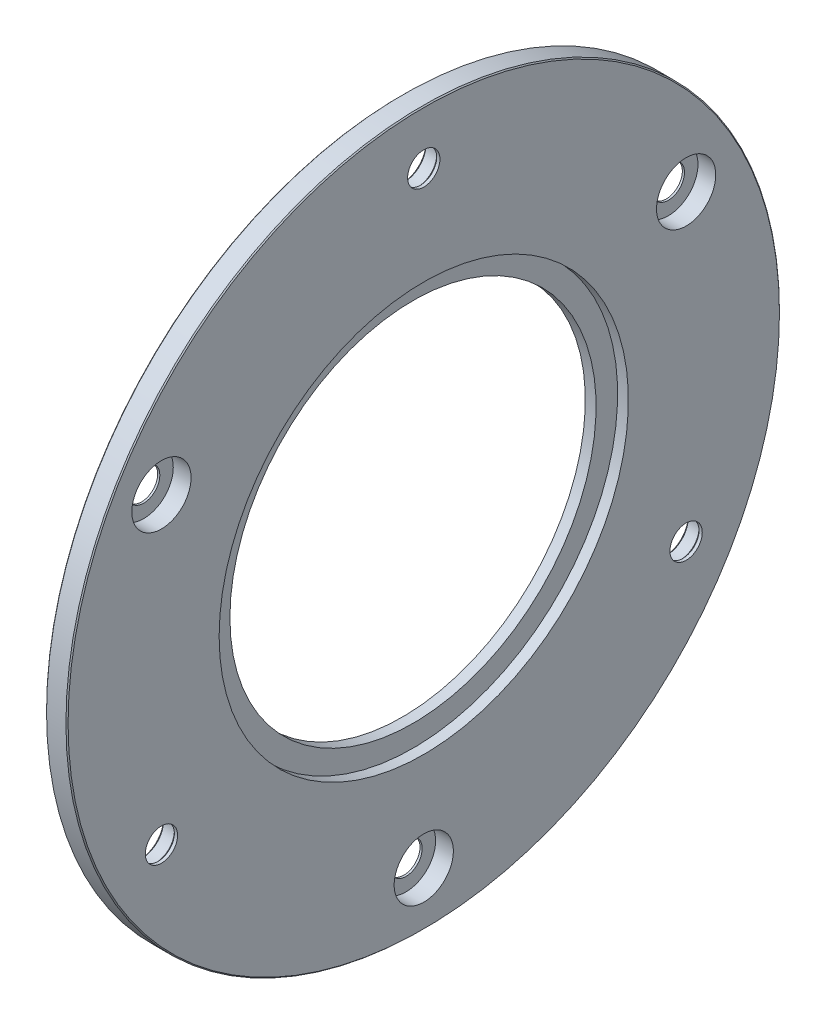
ISO-10303-21;
HEADER;
FILE_DESCRIPTION(('STEP AP214'),'2;1');
FILE_NAME('part.step','',(''),(''),'','','');
FILE_SCHEMA(('AUTOMOTIVE_DESIGN { 1 0 10303 214 1 1 1 1 }'));
ENDSEC;
DATA;
#1=APPLICATION_CONTEXT('core data for automotive mechanical design processes');
#2=APPLICATION_PROTOCOL_DEFINITION('international standard','automotive_design',2000,#1);
#3=PRODUCT_CONTEXT('',#1,'mechanical');
#4=PRODUCT('Part','Part','',(#3));
#5=PRODUCT_RELATED_PRODUCT_CATEGORY('part','',(#4));
#6=PRODUCT_DEFINITION_FORMATION('','',#4);
#7=PRODUCT_DEFINITION_CONTEXT('part definition',#1,'design');
#8=PRODUCT_DEFINITION('design','',#6,#7);
#9=PRODUCT_DEFINITION_SHAPE('','',#8);
#10=(LENGTH_UNIT() NAMED_UNIT(*) SI_UNIT(.MILLI.,.METRE.));
#11=(NAMED_UNIT(*) PLANE_ANGLE_UNIT() SI_UNIT($,.RADIAN.));
#12=(NAMED_UNIT(*) SI_UNIT($,.STERADIAN.) SOLID_ANGLE_UNIT());
#13=UNCERTAINTY_MEASURE_WITH_UNIT(LENGTH_MEASURE(1.E-05),#10,'distance_accuracy_value','');
#14=(GEOMETRIC_REPRESENTATION_CONTEXT(3) GLOBAL_UNCERTAINTY_ASSIGNED_CONTEXT((#13)) GLOBAL_UNIT_ASSIGNED_CONTEXT((#10,
#11,#12)) REPRESENTATION_CONTEXT('',''));
#15=CARTESIAN_POINT('',(0.,0.,0.));
#16=DIRECTION('',(0.,0.,1.));
#17=DIRECTION('',(1.,0.,0.));
#18=AXIS2_PLACEMENT_3D('',#15,#16,#17);
#19=CARTESIAN_POINT('',(34.,0.,0.));
#20=DIRECTION('',(1.,0.,0.));
#21=DIRECTION('',(0.,0.,-1.));
#22=AXIS2_PLACEMENT_3D('',#19,#20,#21);
#23=PLANE('',#22);
#24=CARTESIAN_POINT('',(34.,-28.1250000000002,48.7139289628746));
#25=DIRECTION('',(1.,0.,0.));
#26=DIRECTION('',(0.,0.,-1.));
#27=AXIS2_PLACEMENT_3D('',#24,#25,#26);
#28=CIRCLE('',#27,3.8);
#29=CARTESIAN_POINT('',(34.,-28.1250000000002,44.9139289628746));
#30=VERTEX_POINT('',#29);
#31=EDGE_CURVE('E72',#30,#30,#28,.F.);
#32=ORIENTED_EDGE('',*,*,#31,.T.);
#33=EDGE_LOOP('',(#32));
#34=FACE_BOUND('',#33,.T.);
#35=CARTESIAN_POINT('',(34.,-28.1250000000002,48.7139289628746));
#36=DIRECTION('',(1.,0.,0.));
#37=DIRECTION('',(0.,0.,-1.));
#38=AXIS2_PLACEMENT_3D('',#35,#36,#37);
#39=CIRCLE('',#38,3.39999999999993);
#40=CARTESIAN_POINT('',(34.,-28.1250000000002,45.3139289628746));
#41=VERTEX_POINT('',#40);
#42=EDGE_CURVE('E99',#41,#41,#39,.T.);
#43=ORIENTED_EDGE('',*,*,#42,.T.);
#44=EDGE_LOOP('',(#43));
#45=FACE_BOUND('',#44,.T.);
#46=ADVANCED_FACE('F35',(#34,#45),#23,.F.);
#47=CARTESIAN_POINT('',(34.,0.,0.));
#48=DIRECTION('',(1.,0.,0.));
#49=DIRECTION('',(0.,0.,-1.));
#50=AXIS2_PLACEMENT_3D('',#47,#48,#49);
#51=PLANE('',#50);
#52=CARTESIAN_POINT('',(34.,-28.1249999999995,-48.7139289628749));
#53=DIRECTION('',(1.,0.,0.));
#54=DIRECTION('',(0.,0.,-1.));
#55=AXIS2_PLACEMENT_3D('',#52,#53,#54);
#56=CIRCLE('',#55,3.8);
#57=CARTESIAN_POINT('',(34.,-28.1249999999995,-52.5139289628749));
#58=VERTEX_POINT('',#57);
#59=EDGE_CURVE('E56',#58,#58,#56,.F.);
#60=ORIENTED_EDGE('',*,*,#59,.T.);
#61=EDGE_LOOP('',(#60));
#62=FACE_BOUND('',#61,.T.);
#63=CARTESIAN_POINT('',(34.,-28.1249999999995,-48.7139289628749));
#64=DIRECTION('',(1.,0.,0.));
#65=DIRECTION('',(0.,0.,-1.));
#66=AXIS2_PLACEMENT_3D('',#63,#64,#65);
#67=CIRCLE('',#66,3.39999999999993);
#68=CARTESIAN_POINT('',(34.,-28.1249999999995,-52.1139289628749));
#69=VERTEX_POINT('',#68);
#70=EDGE_CURVE('E87',#69,#69,#67,.T.);
#71=ORIENTED_EDGE('',*,*,#70,.T.);
#72=EDGE_LOOP('',(#71));
#73=FACE_BOUND('',#72,.T.);
#74=ADVANCED_FACE('F242',(#62,#73),#51,.F.);
#75=CARTESIAN_POINT('',(34.,0.,0.));
#76=DIRECTION('',(1.,0.,0.));
#77=DIRECTION('',(0.,0.,-1.));
#78=AXIS2_PLACEMENT_3D('',#75,#76,#77);
#79=PLANE('',#78);
#80=CARTESIAN_POINT('',(34.,56.25,0.));
#81=DIRECTION('',(1.,0.,0.));
#82=DIRECTION('',(0.,0.,-1.));
#83=AXIS2_PLACEMENT_3D('',#80,#81,#82);
#84=CIRCLE('',#83,3.8);
#85=CARTESIAN_POINT('',(34.,56.25,-3.8));
#86=VERTEX_POINT('',#85);
#87=EDGE_CURVE('E102',#86,#86,#84,.F.);
#88=ORIENTED_EDGE('',*,*,#87,.T.);
#89=EDGE_LOOP('',(#88));
#90=FACE_BOUND('',#89,.T.);
#91=CARTESIAN_POINT('',(34.,56.25,0.));
#92=DIRECTION('',(1.,0.,0.));
#93=DIRECTION('',(0.,0.,-1.));
#94=AXIS2_PLACEMENT_3D('',#91,#92,#93);
#95=CIRCLE('',#94,3.39999999999999);
#96=CARTESIAN_POINT('',(34.,56.25,-3.39999999999999));
#97=VERTEX_POINT('',#96);
#98=EDGE_CURVE('E122',#97,#97,#95,.T.);
#99=ORIENTED_EDGE('',*,*,#98,.T.);
#100=EDGE_LOOP('',(#99));
#101=FACE_BOUND('',#100,.T.);
#102=ADVANCED_FACE('F248',(#90,#101),#79,.F.);
#103=CARTESIAN_POINT('',(33.8,56.25,0.));
#104=DIRECTION('',(1.,0.,0.));
#105=DIRECTION('',(0.,0.,-1.));
#106=AXIS2_PLACEMENT_3D('',#103,#104,#105);
#107=TOROIDAL_SURFACE('',#106,3.8,0.2);
#108=ORIENTED_EDGE('',*,*,#87,.F.);
#109=EDGE_LOOP('',(#108));
#110=FACE_BOUND('',#109,.T.);
#111=CARTESIAN_POINT('',(33.8,56.25,0.));
#112=DIRECTION('',(1.,0.,0.));
#113=DIRECTION('',(0.,0.,-1.));
#114=AXIS2_PLACEMENT_3D('',#111,#112,#113);
#115=CIRCLE('',#114,4.);
#116=CARTESIAN_POINT('',(33.8,56.25,-4.));
#117=VERTEX_POINT('',#116);
#118=EDGE_CURVE('E110',#117,#117,#115,.T.);
#119=ORIENTED_EDGE('',*,*,#118,.F.);
#120=EDGE_LOOP('',(#119));
#121=FACE_BOUND('',#120,.T.);
#122=ADVANCED_FACE('F290',(#110,#121),#107,.F.);
#123=CARTESIAN_POINT('',(35.,28.125,-48.7139289628747));
#124=DIRECTION('',(1.,0.,0.));
#125=DIRECTION('',(0.,0.,-1.));
#126=AXIS2_PLACEMENT_3D('',#123,#124,#125);
#127=CYLINDRICAL_SURFACE('',#126,3.);
#128=CARTESIAN_POINT('',(31.7,28.125,-48.7139289628747));
#129=DIRECTION('',(1.,0.,0.));
#130=DIRECTION('',(0.,0.,-1.));
#131=AXIS2_PLACEMENT_3D('',#128,#129,#130);
#132=CIRCLE('',#131,3.);
#133=CARTESIAN_POINT('',(31.7,28.125,-51.7139289628747));
#134=VERTEX_POINT('',#133);
#135=EDGE_CURVE('E107',#134,#134,#132,.T.);
#136=ORIENTED_EDGE('',*,*,#135,.T.);
#137=EDGE_LOOP('',(#136));
#138=FACE_BOUND('',#137,.T.);
#139=CARTESIAN_POINT('',(31.3,28.125,-48.7139289628747));
#140=DIRECTION('',(1.,0.,0.));
#141=DIRECTION('',(0.,0.,-1.));
#142=AXIS2_PLACEMENT_3D('',#139,#140,#141);
#143=CIRCLE('',#142,3.);
#144=CARTESIAN_POINT('',(31.3,28.125,-51.7139289628747));
#145=VERTEX_POINT('',#144);
#146=EDGE_CURVE('E103',#145,#145,#143,.T.);
#147=ORIENTED_EDGE('',*,*,#146,.F.);
#148=EDGE_LOOP('',(#147));
#149=FACE_BOUND('',#148,.T.);
#150=ADVANCED_FACE('F286',(#138,#149),#127,.F.);
#151=CARTESIAN_POINT('',(33.8,-28.1250000000002,48.7139289628746));
#152=DIRECTION('',(1.,0.,0.));
#153=DIRECTION('',(0.,0.,-1.));
#154=AXIS2_PLACEMENT_3D('',#151,#152,#153);
#155=TOROIDAL_SURFACE('',#154,3.8,0.2);
#156=ORIENTED_EDGE('',*,*,#31,.F.);
#157=EDGE_LOOP('',(#156));
#158=FACE_BOUND('',#157,.T.);
#159=CARTESIAN_POINT('',(33.8,-28.1250000000002,48.7139289628746));
#160=DIRECTION('',(1.,0.,0.));
#161=DIRECTION('',(0.,0.,-1.));
#162=AXIS2_PLACEMENT_3D('',#159,#160,#161);
#163=CIRCLE('',#162,4.);
#164=CARTESIAN_POINT('',(33.8,-28.1250000000002,44.7139289628746));
#165=VERTEX_POINT('',#164);
#166=EDGE_CURVE('E75',#165,#165,#163,.T.);
#167=ORIENTED_EDGE('',*,*,#166,.F.);
#168=EDGE_LOOP('',(#167));
#169=FACE_BOUND('',#168,.T.);
#170=ADVANCED_FACE('F289',(#158,#169),#155,.F.);
#171=CARTESIAN_POINT('',(33.8,-28.1249999999995,-48.7139289628749));
#172=DIRECTION('',(1.,0.,0.));
#173=DIRECTION('',(0.,0.,-1.));
#174=AXIS2_PLACEMENT_3D('',#171,#172,#173);
#175=TOROIDAL_SURFACE('',#174,3.8,0.2);
#176=ORIENTED_EDGE('',*,*,#59,.F.);
#177=EDGE_LOOP('',(#176));
#178=FACE_BOUND('',#177,.T.);
#179=CARTESIAN_POINT('',(33.8,-28.1249999999995,-48.7139289628749));
#180=DIRECTION('',(1.,0.,0.));
#181=DIRECTION('',(0.,0.,-1.));
#182=AXIS2_PLACEMENT_3D('',#179,#180,#181);
#183=CIRCLE('',#182,4.);
#184=CARTESIAN_POINT('',(33.8,-28.1249999999995,-52.7139289628749));
#185=VERTEX_POINT('',#184);
#186=EDGE_CURVE('E69',#185,#185,#183,.T.);
#187=ORIENTED_EDGE('',*,*,#186,.F.);
#188=EDGE_LOOP('',(#187));
#189=FACE_BOUND('',#188,.T.);
#190=ADVANCED_FACE('F355',(#178,#189),#175,.F.);
#191=CARTESIAN_POINT('',(35.,-56.25,-5.27355936696949E-13));
#192=DIRECTION('',(1.,0.,0.));
#193=DIRECTION('',(0.,0.,-1.));
#194=AXIS2_PLACEMENT_3D('',#191,#192,#193);
#195=CYLINDRICAL_SURFACE('',#194,3.);
#196=CARTESIAN_POINT('',(31.7,-56.25,-5.27355936696949E-13));
#197=DIRECTION('',(1.,0.,0.));
#198=DIRECTION('',(0.,0.,-1.));
#199=AXIS2_PLACEMENT_3D('',#196,#197,#198);
#200=CIRCLE('',#199,3.);
#201=CARTESIAN_POINT('',(31.7,-56.25,-3.00000000000053));
#202=VERTEX_POINT('',#201);
#203=EDGE_CURVE('E61',#202,#202,#200,.T.);
#204=ORIENTED_EDGE('',*,*,#203,.T.);
#205=EDGE_LOOP('',(#204));
#206=FACE_BOUND('',#205,.T.);
#207=CARTESIAN_POINT('',(31.3,-56.25,-5.27355936696949E-13));
#208=DIRECTION('',(1.,0.,0.));
#209=DIRECTION('',(0.,0.,-1.));
#210=AXIS2_PLACEMENT_3D('',#207,#208,#209);
#211=CIRCLE('',#210,3.);
#212=CARTESIAN_POINT('',(31.3,-56.25,-3.00000000000053));
#213=VERTEX_POINT('',#212);
#214=EDGE_CURVE('E57',#213,#213,#211,.T.);
#215=ORIENTED_EDGE('',*,*,#214,.F.);
#216=EDGE_LOOP('',(#215));
#217=FACE_BOUND('',#216,.T.);
#218=ADVANCED_FACE('F353',(#206,#217),#195,.F.);
#219=CARTESIAN_POINT('',(35.,28.1249999999998,48.7139289628748));
#220=DIRECTION('',(1.,0.,0.));
#221=DIRECTION('',(0.,0.,-1.));
#222=AXIS2_PLACEMENT_3D('',#219,#220,#221);
#223=CYLINDRICAL_SURFACE('',#222,3.);
#224=CARTESIAN_POINT('',(31.7,28.1249999999998,48.7139289628748));
#225=DIRECTION('',(1.,0.,0.));
#226=DIRECTION('',(0.,0.,-1.));
#227=AXIS2_PLACEMENT_3D('',#224,#225,#226);
#228=CIRCLE('',#227,3.);
#229=CARTESIAN_POINT('',(31.7,28.1249999999998,45.7139289628748));
#230=VERTEX_POINT('',#229);
#231=EDGE_CURVE('E66',#230,#230,#228,.T.);
#232=ORIENTED_EDGE('',*,*,#231,.T.);
#233=EDGE_LOOP('',(#232));
#234=FACE_BOUND('',#233,.T.);
#235=CARTESIAN_POINT('',(31.3,28.1249999999998,48.7139289628748));
#236=DIRECTION('',(1.,0.,0.));
#237=DIRECTION('',(0.,0.,-1.));
#238=AXIS2_PLACEMENT_3D('',#235,#236,#237);
#239=CIRCLE('',#238,3.);
#240=CARTESIAN_POINT('',(31.3,28.1249999999998,45.7139289628748));
#241=VERTEX_POINT('',#240);
#242=EDGE_CURVE('E62',#241,#241,#239,.T.);
#243=ORIENTED_EDGE('',*,*,#242,.F.);
#244=EDGE_LOOP('',(#243));
#245=FACE_BOUND('',#244,.T.);
#246=ADVANCED_FACE('F351',(#234,#245),#223,.F.);
#247=CARTESIAN_POINT('',(31.7,-53.25,-5.27355936696949E-13));
#248=DIRECTION('',(-1.,0.,0.));
#249=DIRECTION('',(0.,0.,1.));
#250=AXIS2_PLACEMENT_3D('',#247,#248,#249);
#251=PLANE('',#250);
#252=ORIENTED_EDGE('',*,*,#203,.F.);
#253=EDGE_LOOP('',(#252));
#254=FACE_BOUND('',#253,.T.);
#255=CARTESIAN_POINT('',(31.7,-56.25,-5.27355936696949E-13));
#256=DIRECTION('',(1.,0.,0.));
#257=DIRECTION('',(0.,0.,-1.));
#258=AXIS2_PLACEMENT_3D('',#255,#256,#257);
#259=CIRCLE('',#258,5.5);
#260=CARTESIAN_POINT('',(31.7,-56.25,-5.50000000000052));
#261=VERTEX_POINT('',#260);
#262=EDGE_CURVE('E167',#261,#261,#259,.T.);
#263=ORIENTED_EDGE('',*,*,#262,.T.);
#264=EDGE_LOOP('',(#263));
#265=FACE_BOUND('',#264,.T.);
#266=ADVANCED_FACE('F347',(#254,#265),#251,.F.);
#267=CARTESIAN_POINT('',(31.7,31.1249999999998,48.7139289628748));
#268=DIRECTION('',(-1.,0.,0.));
#269=DIRECTION('',(0.,0.,1.));
#270=AXIS2_PLACEMENT_3D('',#267,#268,#269);
#271=PLANE('',#270);
#272=ORIENTED_EDGE('',*,*,#231,.F.);
#273=EDGE_LOOP('',(#272));
#274=FACE_BOUND('',#273,.T.);
#275=CARTESIAN_POINT('',(31.7,28.1249999999998,48.7139289628748));
#276=DIRECTION('',(1.,0.,0.));
#277=DIRECTION('',(0.,0.,-1.));
#278=AXIS2_PLACEMENT_3D('',#275,#276,#277);
#279=CIRCLE('',#278,5.5);
#280=CARTESIAN_POINT('',(31.7,28.1249999999998,43.2139289628748));
#281=VERTEX_POINT('',#280);
#282=EDGE_CURVE('E160',#281,#281,#279,.T.);
#283=ORIENTED_EDGE('',*,*,#282,.T.);
#284=EDGE_LOOP('',(#283));
#285=FACE_BOUND('',#284,.T.);
#286=ADVANCED_FACE('F350',(#274,#285),#271,.F.);
#287=CARTESIAN_POINT('',(34.,-28.1250000000002,48.7139289628746));
#288=DIRECTION('',(-1.,0.,0.));
#289=DIRECTION('',(0.,0.,1.));
#290=AXIS2_PLACEMENT_3D('',#287,#288,#289);
#291=CONICAL_SURFACE('',#290,3.39999999999993,0.785398163397433);
#292=CARTESIAN_POINT('',(34.3999999999999,-28.1250000000002,48.7139289628746));
#293=DIRECTION('',(1.,0.,0.));
#294=DIRECTION('',(0.,0.,-1.));
#295=AXIS2_PLACEMENT_3D('',#292,#293,#294);
#296=CIRCLE('',#295,3.);
#297=CARTESIAN_POINT('',(34.3999999999999,-28.1250000000002,45.7139289628746));
#298=VERTEX_POINT('',#297);
#299=EDGE_CURVE('E96',#298,#298,#296,.F.);
#300=ORIENTED_EDGE('',*,*,#299,.F.);
#301=EDGE_LOOP('',(#300));
#302=FACE_BOUND('',#301,.T.);
#303=ORIENTED_EDGE('',*,*,#42,.F.);
#304=EDGE_LOOP('',(#303));
#305=FACE_BOUND('',#304,.T.);
#306=ADVANCED_FACE('F360',(#302,#305),#291,.F.);
#307=CARTESIAN_POINT('',(34.,-28.1249999999995,-48.7139289628749));
#308=DIRECTION('',(-1.,0.,0.));
#309=DIRECTION('',(0.,0.,1.));
#310=AXIS2_PLACEMENT_3D('',#307,#308,#309);
#311=CONICAL_SURFACE('',#310,3.39999999999993,0.785398163397433);
#312=CARTESIAN_POINT('',(34.3999999999999,-28.1249999999995,-48.7139289628749));
#313=DIRECTION('',(1.,0.,0.));
#314=DIRECTION('',(0.,0.,-1.));
#315=AXIS2_PLACEMENT_3D('',#312,#313,#314);
#316=CIRCLE('',#315,3.);
#317=CARTESIAN_POINT('',(34.3999999999999,-28.1249999999995,-51.7139289628749));
#318=VERTEX_POINT('',#317);
#319=EDGE_CURVE('E84',#318,#318,#316,.F.);
#320=ORIENTED_EDGE('',*,*,#319,.F.);
#321=EDGE_LOOP('',(#320));
#322=FACE_BOUND('',#321,.T.);
#323=ORIENTED_EDGE('',*,*,#70,.F.);
#324=EDGE_LOOP('',(#323));
#325=FACE_BOUND('',#324,.T.);
#326=ADVANCED_FACE('F284',(#322,#325),#311,.F.);
#327=CARTESIAN_POINT('',(31.7,31.125,-48.7139289628747));
#328=DIRECTION('',(-1.,0.,0.));
#329=DIRECTION('',(0.,0.,1.));
#330=AXIS2_PLACEMENT_3D('',#327,#328,#329);
#331=PLANE('',#330);
#332=ORIENTED_EDGE('',*,*,#135,.F.);
#333=EDGE_LOOP('',(#332));
#334=FACE_BOUND('',#333,.T.);
#335=CARTESIAN_POINT('',(31.7,28.125,-48.7139289628747));
#336=DIRECTION('',(1.,0.,0.));
#337=DIRECTION('',(0.,0.,-1.));
#338=AXIS2_PLACEMENT_3D('',#335,#336,#337);
#339=CIRCLE('',#338,5.5);
#340=CARTESIAN_POINT('',(31.7,28.125,-54.2139289628747));
#341=VERTEX_POINT('',#340);
#342=EDGE_CURVE('E135',#341,#341,#339,.T.);
#343=ORIENTED_EDGE('',*,*,#342,.T.);
#344=EDGE_LOOP('',(#343));
#345=FACE_BOUND('',#344,.T.);
#346=ADVANCED_FACE('F280',(#334,#345),#331,.F.);
#347=CARTESIAN_POINT('',(34.,56.25,0.));
#348=DIRECTION('',(-1.,0.,0.));
#349=DIRECTION('',(0.,0.,1.));
#350=AXIS2_PLACEMENT_3D('',#347,#348,#349);
#351=CONICAL_SURFACE('',#350,3.39999999999999,0.785398163397459);
#352=CARTESIAN_POINT('',(34.4,56.25,0.));
#353=DIRECTION('',(1.,0.,0.));
#354=DIRECTION('',(0.,0.,-1.));
#355=AXIS2_PLACEMENT_3D('',#352,#353,#354);
#356=CIRCLE('',#355,3.);
#357=CARTESIAN_POINT('',(34.4,56.25,-3.));
#358=VERTEX_POINT('',#357);
#359=EDGE_CURVE('E119',#358,#358,#356,.F.);
#360=ORIENTED_EDGE('',*,*,#359,.F.);
#361=EDGE_LOOP('',(#360));
#362=FACE_BOUND('',#361,.T.);
#363=ORIENTED_EDGE('',*,*,#98,.F.);
#364=EDGE_LOOP('',(#363));
#365=FACE_BOUND('',#364,.T.);
#366=ADVANCED_FACE('F283',(#362,#365),#351,.F.);
#367=CARTESIAN_POINT('',(46.3137084989848,56.25,0.));
#368=DIRECTION('',(-1.,0.,0.));
#369=DIRECTION('',(0.,0.,1.));
#370=AXIS2_PLACEMENT_3D('',#367,#368,#369);
#371=CYLINDRICAL_SURFACE('',#370,4.);
#372=ORIENTED_EDGE('',*,*,#118,.T.);
#373=EDGE_LOOP('',(#372));
#374=FACE_BOUND('',#373,.T.);
#375=CARTESIAN_POINT('',(31.3999999999999,56.25,0.));
#376=DIRECTION('',(1.,0.,0.));
#377=DIRECTION('',(0.,0.,-1.));
#378=AXIS2_PLACEMENT_3D('',#375,#376,#377);
#379=CIRCLE('',#378,4.);
#380=CARTESIAN_POINT('',(31.3999999999999,56.25,-4.));
#381=VERTEX_POINT('',#380);
#382=EDGE_CURVE('E113',#381,#381,#379,.F.);
#383=ORIENTED_EDGE('',*,*,#382,.T.);
#384=EDGE_LOOP('',(#383));
#385=FACE_BOUND('',#384,.T.);
#386=ADVANCED_FACE('F293',(#374,#385),#371,.F.);
#387=CARTESIAN_POINT('',(31.3,28.125,-48.7139289628747));
#388=DIRECTION('',(1.,0.,0.));
#389=DIRECTION('',(0.,0.,-1.));
#390=AXIS2_PLACEMENT_3D('',#387,#388,#389);
#391=PLANE('',#390);
#392=ORIENTED_EDGE('',*,*,#146,.T.);
#393=EDGE_LOOP('',(#392));
#394=FACE_BOUND('',#393,.T.);
#395=CARTESIAN_POINT('',(31.3,28.125,-48.7139289628747));
#396=DIRECTION('',(1.,0.,0.));
#397=DIRECTION('',(0.,0.,-1.));
#398=AXIS2_PLACEMENT_3D('',#395,#396,#397);
#399=CIRCLE('',#398,8.05);
#400=CARTESIAN_POINT('',(31.3,28.125,-56.7639289628747));
#401=VERTEX_POINT('',#400);
#402=EDGE_CURVE('E128',#401,#401,#399,.T.);
#403=ORIENTED_EDGE('',*,*,#402,.F.);
#404=EDGE_LOOP('',(#403));
#405=FACE_BOUND('',#404,.T.);
#406=ADVANCED_FACE('F259',(#394,#405),#391,.F.);
#407=CARTESIAN_POINT('',(46.3137084989848,-28.1250000000002,48.7139289628746));
#408=DIRECTION('',(-1.,0.,0.));
#409=DIRECTION('',(0.,0.,1.));
#410=AXIS2_PLACEMENT_3D('',#407,#408,#409);
#411=CYLINDRICAL_SURFACE('',#410,4.);
#412=ORIENTED_EDGE('',*,*,#166,.T.);
#413=EDGE_LOOP('',(#412));
#414=FACE_BOUND('',#413,.T.);
#415=CARTESIAN_POINT('',(31.3999999999999,-28.1250000000002,48.7139289628746));
#416=DIRECTION('',(1.,0.,0.));
#417=DIRECTION('',(0.,0.,-1.));
#418=AXIS2_PLACEMENT_3D('',#415,#416,#417);
#419=CIRCLE('',#418,4.);
#420=CARTESIAN_POINT('',(31.3999999999999,-28.1250000000002,44.7139289628746));
#421=VERTEX_POINT('',#420);
#422=EDGE_CURVE('E90',#421,#421,#419,.F.);
#423=ORIENTED_EDGE('',*,*,#422,.T.);
#424=EDGE_LOOP('',(#423));
#425=FACE_BOUND('',#424,.T.);
#426=ADVANCED_FACE('F256',(#414,#425),#411,.F.);
#427=CARTESIAN_POINT('',(46.3137084989848,-28.1249999999995,-48.7139289628749));
#428=DIRECTION('',(-1.,0.,0.));
#429=DIRECTION('',(0.,0.,1.));
#430=AXIS2_PLACEMENT_3D('',#427,#428,#429);
#431=CYLINDRICAL_SURFACE('',#430,4.);
#432=ORIENTED_EDGE('',*,*,#186,.T.);
#433=EDGE_LOOP('',(#432));
#434=FACE_BOUND('',#433,.T.);
#435=CARTESIAN_POINT('',(31.3999999999999,-28.1249999999995,-48.7139289628749));
#436=DIRECTION('',(1.,0.,0.));
#437=DIRECTION('',(0.,0.,-1.));
#438=AXIS2_PLACEMENT_3D('',#435,#436,#437);
#439=CIRCLE('',#438,4.);
#440=CARTESIAN_POINT('',(31.3999999999999,-28.1249999999995,-52.7139289628749));
#441=VERTEX_POINT('',#440);
#442=EDGE_CURVE('E78',#441,#441,#439,.F.);
#443=ORIENTED_EDGE('',*,*,#442,.T.);
#444=EDGE_LOOP('',(#443));
#445=FACE_BOUND('',#444,.T.);
#446=ADVANCED_FACE('F258',(#434,#445),#431,.F.);
#447=CARTESIAN_POINT('',(31.3,-56.25,-5.27355936696949E-13));
#448=DIRECTION('',(1.,0.,0.));
#449=DIRECTION('',(0.,0.,-1.));
#450=AXIS2_PLACEMENT_3D('',#447,#448,#449);
#451=PLANE('',#450);
#452=ORIENTED_EDGE('',*,*,#214,.T.);
#453=EDGE_LOOP('',(#452));
#454=FACE_BOUND('',#453,.T.);
#455=CARTESIAN_POINT('',(31.3,-56.25,-5.27355936696949E-13));
#456=DIRECTION('',(1.,0.,0.));
#457=DIRECTION('',(0.,0.,-1.));
#458=AXIS2_PLACEMENT_3D('',#455,#456,#457);
#459=CIRCLE('',#458,8.05);
#460=CARTESIAN_POINT('',(31.3,-56.25,-8.05000000000053));
#461=VERTEX_POINT('',#460);
#462=EDGE_CURVE('E150',#461,#461,#459,.T.);
#463=ORIENTED_EDGE('',*,*,#462,.F.);
#464=EDGE_LOOP('',(#463));
#465=FACE_BOUND('',#464,.T.);
#466=ADVANCED_FACE('F264',(#454,#465),#451,.F.);
#467=CARTESIAN_POINT('',(31.3,28.1249999999998,48.7139289628748));
#468=DIRECTION('',(1.,0.,0.));
#469=DIRECTION('',(0.,0.,-1.));
#470=AXIS2_PLACEMENT_3D('',#467,#468,#469);
#471=PLANE('',#470);
#472=ORIENTED_EDGE('',*,*,#242,.T.);
#473=EDGE_LOOP('',(#472));
#474=FACE_BOUND('',#473,.T.);
#475=CARTESIAN_POINT('',(31.3,28.1249999999998,48.7139289628748));
#476=DIRECTION('',(1.,0.,0.));
#477=DIRECTION('',(0.,0.,-1.));
#478=AXIS2_PLACEMENT_3D('',#475,#476,#477);
#479=CIRCLE('',#478,8.05);
#480=CARTESIAN_POINT('',(31.3,28.1249999999998,40.6639289628748));
#481=VERTEX_POINT('',#480);
#482=EDGE_CURVE('E145',#481,#481,#479,.T.);
#483=ORIENTED_EDGE('',*,*,#482,.F.);
#484=EDGE_LOOP('',(#483));
#485=FACE_BOUND('',#484,.T.);
#486=ADVANCED_FACE('F334',(#474,#485),#471,.F.);
#487=CARTESIAN_POINT('',(35.,-56.25,-5.27355936696949E-13));
#488=DIRECTION('',(1.,0.,0.));
#489=DIRECTION('',(0.,0.,-1.));
#490=AXIS2_PLACEMENT_3D('',#487,#488,#489);
#491=CYLINDRICAL_SURFACE('',#490,5.5);
#492=ORIENTED_EDGE('',*,*,#262,.F.);
#493=EDGE_LOOP('',(#492));
#494=FACE_BOUND('',#493,.T.);
#495=CARTESIAN_POINT('',(35.,-56.25,-5.27355936696949E-13));
#496=DIRECTION('',(1.,0.,0.));
#497=DIRECTION('',(0.,0.,-1.));
#498=AXIS2_PLACEMENT_3D('',#495,#496,#497);
#499=CIRCLE('',#498,5.5);
#500=CARTESIAN_POINT('',(35.,-56.25,-5.50000000000052));
#501=VERTEX_POINT('',#500);
#502=EDGE_CURVE('E170',#501,#501,#499,.T.);
#503=ORIENTED_EDGE('',*,*,#502,.T.);
#504=EDGE_LOOP('',(#503));
#505=FACE_BOUND('',#504,.T.);
#506=ADVANCED_FACE('F332',(#494,#505),#491,.F.);
#507=CARTESIAN_POINT('',(35.,28.1249999999998,48.7139289628748));
#508=DIRECTION('',(1.,0.,0.));
#509=DIRECTION('',(0.,0.,-1.));
#510=AXIS2_PLACEMENT_3D('',#507,#508,#509);
#511=CYLINDRICAL_SURFACE('',#510,5.5);
#512=ORIENTED_EDGE('',*,*,#282,.F.);
#513=EDGE_LOOP('',(#512));
#514=FACE_BOUND('',#513,.T.);
#515=CARTESIAN_POINT('',(35.,28.1249999999998,48.7139289628748));
#516=DIRECTION('',(1.,0.,0.));
#517=DIRECTION('',(0.,0.,-1.));
#518=AXIS2_PLACEMENT_3D('',#515,#516,#517);
#519=CIRCLE('',#518,5.5);
#520=CARTESIAN_POINT('',(35.,28.1249999999998,43.2139289628748));
#521=VERTEX_POINT('',#520);
#522=EDGE_CURVE('E60',#521,#521,#519,.T.);
#523=ORIENTED_EDGE('',*,*,#522,.T.);
#524=EDGE_LOOP('',(#523));
#525=FACE_BOUND('',#524,.T.);
#526=ADVANCED_FACE('F270',(#514,#525),#511,.F.);
#527=CARTESIAN_POINT('',(22.5147186257614,-28.1250000000002,48.7139289628746));
#528=DIRECTION('',(1.,0.,0.));
#529=DIRECTION('',(0.,0.,-1.));
#530=AXIS2_PLACEMENT_3D('',#527,#528,#529);
#531=CYLINDRICAL_SURFACE('',#530,3.);
#532=ORIENTED_EDGE('',*,*,#299,.T.);
#533=EDGE_LOOP('',(#532));
#534=FACE_BOUND('',#533,.T.);
#535=CARTESIAN_POINT('',(35.,-28.1250000000002,48.7139289628746));
#536=DIRECTION('',(1.,0.,0.));
#537=DIRECTION('',(0.,0.866025403784436,0.500000000000004));
#538=AXIS2_PLACEMENT_3D('',#535,#536,#537);
#539=CIRCLE('',#538,3.);
#540=CARTESIAN_POINT('',(35.,-25.5269237886469,50.2139289628746));
#541=VERTEX_POINT('',#540);
#542=EDGE_CURVE('E141',#541,#541,#539,.T.);
#543=ORIENTED_EDGE('',*,*,#542,.T.);
#544=EDGE_LOOP('',(#543));
#545=FACE_BOUND('',#544,.T.);
#546=ADVANCED_FACE('F266',(#534,#545),#531,.F.);
#547=CARTESIAN_POINT('',(22.5147186257614,-28.1249999999995,-48.7139289628749));
#548=DIRECTION('',(1.,0.,0.));
#549=DIRECTION('',(0.,0.,-1.));
#550=AXIS2_PLACEMENT_3D('',#547,#548,#549);
#551=CYLINDRICAL_SURFACE('',#550,3.);
#552=ORIENTED_EDGE('',*,*,#319,.T.);
#553=EDGE_LOOP('',(#552));
#554=FACE_BOUND('',#553,.T.);
#555=CARTESIAN_POINT('',(35.,-28.1249999999995,-48.7139289628749));
#556=DIRECTION('',(1.,0.,0.));
#557=DIRECTION('',(0.,-0.866025403784443,0.499999999999992));
#558=AXIS2_PLACEMENT_3D('',#555,#556,#557);
#559=CIRCLE('',#558,3.);
#560=CARTESIAN_POINT('',(35.,-30.7230762113529,-47.213928962875));
#561=VERTEX_POINT('',#560);
#562=EDGE_CURVE('E142',#561,#561,#559,.T.);
#563=ORIENTED_EDGE('',*,*,#562,.T.);
#564=EDGE_LOOP('',(#563));
#565=FACE_BOUND('',#564,.T.);
#566=ADVANCED_FACE('F269',(#554,#565),#551,.F.);
#567=CARTESIAN_POINT('',(35.,28.125,-48.7139289628747));
#568=DIRECTION('',(1.,0.,0.));
#569=DIRECTION('',(0.,0.,-1.));
#570=AXIS2_PLACEMENT_3D('',#567,#568,#569);
#571=CYLINDRICAL_SURFACE('',#570,5.5);
#572=ORIENTED_EDGE('',*,*,#342,.F.);
#573=EDGE_LOOP('',(#572));
#574=FACE_BOUND('',#573,.T.);
#575=CARTESIAN_POINT('',(35.,28.125,-48.7139289628747));
#576=DIRECTION('',(1.,0.,0.));
#577=DIRECTION('',(0.,0.,-1.));
#578=AXIS2_PLACEMENT_3D('',#575,#576,#577);
#579=CIRCLE('',#578,5.5);
#580=CARTESIAN_POINT('',(35.,28.125,-54.2139289628747));
#581=VERTEX_POINT('',#580);
#582=EDGE_CURVE('E138',#581,#581,#579,.T.);
#583=ORIENTED_EDGE('',*,*,#582,.T.);
#584=EDGE_LOOP('',(#583));
#585=FACE_BOUND('',#584,.T.);
#586=ADVANCED_FACE('F274',(#574,#585),#571,.F.);
#587=CARTESIAN_POINT('',(22.5147186257614,56.25,0.));
#588=DIRECTION('',(1.,0.,0.));
#589=DIRECTION('',(0.,0.,-1.));
#590=AXIS2_PLACEMENT_3D('',#587,#588,#589);
#591=CYLINDRICAL_SURFACE('',#590,3.);
#592=ORIENTED_EDGE('',*,*,#359,.T.);
#593=EDGE_LOOP('',(#592));
#594=FACE_BOUND('',#593,.T.);
#595=CARTESIAN_POINT('',(35.,56.25,0.));
#596=DIRECTION('',(1.,0.,0.));
#597=DIRECTION('',(0.,0.,-1.));
#598=AXIS2_PLACEMENT_3D('',#595,#596,#597);
#599=CIRCLE('',#598,3.);
#600=CARTESIAN_POINT('',(35.,56.25,-3.));
#601=VERTEX_POINT('',#600);
#602=EDGE_CURVE('E125',#601,#601,#599,.T.);
#603=ORIENTED_EDGE('',*,*,#602,.T.);
#604=EDGE_LOOP('',(#603));
#605=FACE_BOUND('',#604,.T.);
#606=ADVANCED_FACE('F278',(#594,#605),#591,.F.);
#607=CARTESIAN_POINT('',(35.,0.,0.));
#608=DIRECTION('',(-1.,0.,0.));
#609=DIRECTION('',(0.,0.,1.));
#610=AXIS2_PLACEMENT_3D('',#607,#608,#609);
#611=CONICAL_SURFACE('',#610,66.0500000000001,0.785398163397448);
#612=CARTESIAN_POINT('',(34.8,0.,0.));
#613=DIRECTION('',(1.,0.,0.));
#614=DIRECTION('',(0.,0.,-1.));
#615=AXIS2_PLACEMENT_3D('',#612,#613,#614);
#616=CIRCLE('',#615,66.25);
#617=CARTESIAN_POINT('',(34.8,0.,-66.25));
#618=VERTEX_POINT('',#617);
#619=EDGE_CURVE('E43',#618,#618,#616,.F.);
#620=ORIENTED_EDGE('',*,*,#619,.F.);
#621=EDGE_LOOP('',(#620));
#622=FACE_BOUND('',#621,.T.);
#623=CARTESIAN_POINT('',(35.,0.,0.));
#624=DIRECTION('',(1.,0.,0.));
#625=DIRECTION('',(0.,0.,-1.));
#626=AXIS2_PLACEMENT_3D('',#623,#624,#625);
#627=CIRCLE('',#626,66.0500000000001);
#628=CARTESIAN_POINT('',(35.,0.,-66.0500000000001));
#629=VERTEX_POINT('',#628);
#630=EDGE_CURVE('E51',#629,#629,#627,.T.);
#631=ORIENTED_EDGE('',*,*,#630,.F.);
#632=EDGE_LOOP('',(#631));
#633=FACE_BOUND('',#632,.T.);
#634=ADVANCED_FACE('F304',(#622,#633),#611,.T.);
#635=CARTESIAN_POINT('',(35.,0.,0.));
#636=DIRECTION('',(1.,0.,0.));
#637=DIRECTION('',(0.,0.,-1.));
#638=AXIS2_PLACEMENT_3D('',#635,#636,#637);
#639=PLANE('',#638);
#640=CARTESIAN_POINT('',(35.,0.,0.));
#641=DIRECTION('',(-1.,0.,0.));
#642=DIRECTION('',(0.,0.,1.));
#643=AXIS2_PLACEMENT_3D('',#640,#641,#642);
#644=CIRCLE('',#643,38.);
#645=CARTESIAN_POINT('',(35.,0.,38.));
#646=VERTEX_POINT('',#645);
#647=EDGE_CURVE('E182',#646,#646,#644,.T.);
#648=ORIENTED_EDGE('',*,*,#647,.T.);
#649=EDGE_LOOP('',(#648));
#650=FACE_BOUND('',#649,.T.);
#651=ORIENTED_EDGE('',*,*,#630,.T.);
#652=EDGE_LOOP('',(#651));
#653=FACE_BOUND('',#652,.T.);
#654=ORIENTED_EDGE('',*,*,#602,.F.);
#655=EDGE_LOOP('',(#654));
#656=FACE_BOUND('',#655,.T.);
#657=ORIENTED_EDGE('',*,*,#582,.F.);
#658=EDGE_LOOP('',(#657));
#659=FACE_BOUND('',#658,.T.);
#660=ORIENTED_EDGE('',*,*,#562,.F.);
#661=EDGE_LOOP('',(#660));
#662=FACE_BOUND('',#661,.T.);
#663=ORIENTED_EDGE('',*,*,#542,.F.);
#664=EDGE_LOOP('',(#663));
#665=FACE_BOUND('',#664,.T.);
#666=ORIENTED_EDGE('',*,*,#522,.F.);
#667=EDGE_LOOP('',(#666));
#668=FACE_BOUND('',#667,.T.);
#669=ORIENTED_EDGE('',*,*,#502,.F.);
#670=EDGE_LOOP('',(#669));
#671=FACE_BOUND('',#670,.T.);
#672=ADVANCED_FACE('F186',(#650,#653,#656,#659,#662,#665,#668,#671),#639,.T.);
#673=CARTESIAN_POINT('',(35.,0.,0.));
#674=DIRECTION('',(-1.,0.,0.));
#675=DIRECTION('',(0.,0.,1.));
#676=AXIS2_PLACEMENT_3D('',#673,#674,#675);
#677=CYLINDRICAL_SURFACE('',#676,66.25);
#678=ORIENTED_EDGE('',*,*,#619,.T.);
#679=EDGE_LOOP('',(#678));
#680=FACE_BOUND('',#679,.T.);
#681=CARTESIAN_POINT('',(31.2,0.,0.));
#682=DIRECTION('',(1.,0.,0.));
#683=DIRECTION('',(0.,0.,-1.));
#684=AXIS2_PLACEMENT_3D('',#681,#682,#683);
#685=CIRCLE('',#684,66.25);
#686=CARTESIAN_POINT('',(31.2,0.,-66.25));
#687=VERTEX_POINT('',#686);
#688=EDGE_CURVE('E47',#687,#687,#685,.T.);
#689=ORIENTED_EDGE('',*,*,#688,.T.);
#690=EDGE_LOOP('',(#689));
#691=FACE_BOUND('',#690,.T.);
#692=ADVANCED_FACE('F226',(#680,#691),#677,.T.);
#693=CARTESIAN_POINT('',(31.,56.25,0.));
#694=DIRECTION('',(-1.,0.,0.));
#695=DIRECTION('',(0.,0.,1.));
#696=AXIS2_PLACEMENT_3D('',#693,#694,#695);
#697=CONICAL_SURFACE('',#696,4.39999999999993,0.785398163397476);
#698=ORIENTED_EDGE('',*,*,#382,.F.);
#699=EDGE_LOOP('',(#698));
#700=FACE_BOUND('',#699,.T.);
#701=CARTESIAN_POINT('',(31.,56.25,0.));
#702=DIRECTION('',(1.,0.,0.));
#703=DIRECTION('',(0.,0.,-1.));
#704=AXIS2_PLACEMENT_3D('',#701,#702,#703);
#705=CIRCLE('',#704,4.39999999999993);
#706=CARTESIAN_POINT('',(31.,56.25,-4.39999999999993));
#707=VERTEX_POINT('',#706);
#708=EDGE_CURVE('E116',#707,#707,#705,.T.);
#709=ORIENTED_EDGE('',*,*,#708,.F.);
#710=EDGE_LOOP('',(#709));
#711=FACE_BOUND('',#710,.T.);
#712=ADVANCED_FACE('F223',(#700,#711),#697,.F.);
#713=CARTESIAN_POINT('',(31.3,28.125,-48.7139289628747));
#714=DIRECTION('',(-1.,0.,0.));
#715=DIRECTION('',(0.,0.,1.));
#716=AXIS2_PLACEMENT_3D('',#713,#714,#715);
#717=CYLINDRICAL_SURFACE('',#716,8.05);
#718=ORIENTED_EDGE('',*,*,#402,.T.);
#719=EDGE_LOOP('',(#718));
#720=FACE_BOUND('',#719,.T.);
#721=CARTESIAN_POINT('',(31.,28.125,-48.7139289628747));
#722=DIRECTION('',(1.,0.,0.));
#723=DIRECTION('',(0.,0.,-1.));
#724=AXIS2_PLACEMENT_3D('',#721,#722,#723);
#725=CIRCLE('',#724,8.05);
#726=CARTESIAN_POINT('',(31.,28.125,-56.7639289628747));
#727=VERTEX_POINT('',#726);
#728=EDGE_CURVE('E106',#727,#727,#725,.T.);
#729=ORIENTED_EDGE('',*,*,#728,.F.);
#730=EDGE_LOOP('',(#729));
#731=FACE_BOUND('',#730,.T.);
#732=ADVANCED_FACE('F225',(#720,#731),#717,.F.);
#733=CARTESIAN_POINT('',(31.,-28.1250000000002,48.7139289628746));
#734=DIRECTION('',(-1.,0.,0.));
#735=DIRECTION('',(0.,0.,1.));
#736=AXIS2_PLACEMENT_3D('',#733,#734,#735);
#737=CONICAL_SURFACE('',#736,4.3999999999999,0.785398163397434);
#738=ORIENTED_EDGE('',*,*,#422,.F.);
#739=EDGE_LOOP('',(#738));
#740=FACE_BOUND('',#739,.T.);
#741=CARTESIAN_POINT('',(31.,-28.1250000000002,48.7139289628746));
#742=DIRECTION('',(1.,0.,0.));
#743=DIRECTION('',(0.,0.,-1.));
#744=AXIS2_PLACEMENT_3D('',#741,#742,#743);
#745=CIRCLE('',#744,4.3999999999999);
#746=CARTESIAN_POINT('',(31.,-28.1250000000002,44.3139289628746));
#747=VERTEX_POINT('',#746);
#748=EDGE_CURVE('E93',#747,#747,#745,.T.);
#749=ORIENTED_EDGE('',*,*,#748,.F.);
#750=EDGE_LOOP('',(#749));
#751=FACE_BOUND('',#750,.T.);
#752=ADVANCED_FACE('F233',(#740,#751),#737,.F.);
#753=CARTESIAN_POINT('',(31.,-28.1249999999995,-48.7139289628749));
#754=DIRECTION('',(-1.,0.,0.));
#755=DIRECTION('',(0.,0.,1.));
#756=AXIS2_PLACEMENT_3D('',#753,#754,#755);
#757=CONICAL_SURFACE('',#756,4.3999999999999,0.785398163397434);
#758=ORIENTED_EDGE('',*,*,#442,.F.);
#759=EDGE_LOOP('',(#758));
#760=FACE_BOUND('',#759,.T.);
#761=CARTESIAN_POINT('',(31.,-28.1249999999995,-48.7139289628749));
#762=DIRECTION('',(1.,0.,0.));
#763=DIRECTION('',(0.,0.,-1.));
#764=AXIS2_PLACEMENT_3D('',#761,#762,#763);
#765=CIRCLE('',#764,4.3999999999999);
#766=CARTESIAN_POINT('',(31.,-28.1249999999995,-53.1139289628748));
#767=VERTEX_POINT('',#766);
#768=EDGE_CURVE('E81',#767,#767,#765,.T.);
#769=ORIENTED_EDGE('',*,*,#768,.F.);
#770=EDGE_LOOP('',(#769));
#771=FACE_BOUND('',#770,.T.);
#772=ADVANCED_FACE('F378',(#760,#771),#757,.F.);
#773=CARTESIAN_POINT('',(31.3,-56.25,-5.27355936696949E-13));
#774=DIRECTION('',(-1.,0.,0.));
#775=DIRECTION('',(0.,0.,1.));
#776=AXIS2_PLACEMENT_3D('',#773,#774,#775);
#777=CYLINDRICAL_SURFACE('',#776,8.05);
#778=ORIENTED_EDGE('',*,*,#462,.T.);
#779=EDGE_LOOP('',(#778));
#780=FACE_BOUND('',#779,.T.);
#781=CARTESIAN_POINT('',(31.,-56.25,-5.27355936696949E-13));
#782=DIRECTION('',(1.,0.,0.));
#783=DIRECTION('',(0.,0.,-1.));
#784=AXIS2_PLACEMENT_3D('',#781,#782,#783);
#785=CIRCLE('',#784,8.05);
#786=CARTESIAN_POINT('',(31.,-56.25,-8.05000000000053));
#787=VERTEX_POINT('',#786);
#788=EDGE_CURVE('E65',#787,#787,#785,.T.);
#789=ORIENTED_EDGE('',*,*,#788,.F.);
#790=EDGE_LOOP('',(#789));
#791=FACE_BOUND('',#790,.T.);
#792=ADVANCED_FACE('F254',(#780,#791),#777,.F.);
#793=CARTESIAN_POINT('',(31.3,28.1249999999998,48.7139289628748));
#794=DIRECTION('',(-1.,0.,0.));
#795=DIRECTION('',(0.,0.,1.));
#796=AXIS2_PLACEMENT_3D('',#793,#794,#795);
#797=CYLINDRICAL_SURFACE('',#796,8.05);
#798=ORIENTED_EDGE('',*,*,#482,.T.);
#799=EDGE_LOOP('',(#798));
#800=FACE_BOUND('',#799,.T.);
#801=CARTESIAN_POINT('',(31.,28.1249999999998,48.7139289628748));
#802=DIRECTION('',(1.,0.,0.));
#803=DIRECTION('',(0.,0.,-1.));
#804=AXIS2_PLACEMENT_3D('',#801,#802,#803);
#805=CIRCLE('',#804,8.05);
#806=CARTESIAN_POINT('',(31.,28.1249999999998,40.6639289628748));
#807=VERTEX_POINT('',#806);
#808=EDGE_CURVE('E153',#807,#807,#805,.T.);
#809=ORIENTED_EDGE('',*,*,#808,.F.);
#810=EDGE_LOOP('',(#809));
#811=FACE_BOUND('',#810,.T.);
#812=ADVANCED_FACE('F365',(#800,#811),#797,.F.);
#813=CARTESIAN_POINT('',(31.2,0.,0.));
#814=DIRECTION('',(1.,0.,0.));
#815=DIRECTION('',(0.,0.,-1.));
#816=AXIS2_PLACEMENT_3D('',#813,#814,#815);
#817=CONICAL_SURFACE('',#816,66.25,0.785398163397414);
#818=CARTESIAN_POINT('',(31.,0.,0.));
#819=DIRECTION('',(1.,0.,0.));
#820=DIRECTION('',(0.,0.,-1.));
#821=AXIS2_PLACEMENT_3D('',#818,#819,#820);
#822=CIRCLE('',#821,66.05);
#823=CARTESIAN_POINT('',(31.,0.,-66.05));
#824=VERTEX_POINT('',#823);
#825=EDGE_CURVE('E11',#824,#824,#822,.F.);
#826=ORIENTED_EDGE('',*,*,#825,.F.);
#827=EDGE_LOOP('',(#826));
#828=FACE_BOUND('',#827,.T.);
#829=ORIENTED_EDGE('',*,*,#688,.F.);
#830=EDGE_LOOP('',(#829));
#831=FACE_BOUND('',#830,.T.);
#832=ADVANCED_FACE('F38',(#828,#831),#817,.T.);
#833=CARTESIAN_POINT('',(31.,0.,0.));
#834=DIRECTION('',(1.,0.,0.));
#835=DIRECTION('',(0.,0.,-1.));
#836=AXIS2_PLACEMENT_3D('',#833,#834,#835);
#837=PLANE('',#836);
#838=CARTESIAN_POINT('',(31.,0.,0.));
#839=DIRECTION('',(-1.,0.,0.));
#840=DIRECTION('',(0.,0.,1.));
#841=AXIS2_PLACEMENT_3D('',#838,#839,#840);
#842=CIRCLE('',#841,34.);
#843=CARTESIAN_POINT('',(31.,0.,34.));
#844=VERTEX_POINT('',#843);
#845=EDGE_CURVE('E173',#844,#844,#842,.T.);
#846=ORIENTED_EDGE('',*,*,#845,.F.);
#847=EDGE_LOOP('',(#846));
#848=FACE_BOUND('',#847,.T.);
#849=ORIENTED_EDGE('',*,*,#825,.T.);
#850=EDGE_LOOP('',(#849));
#851=FACE_BOUND('',#850,.T.);
#852=ORIENTED_EDGE('',*,*,#808,.T.);
#853=EDGE_LOOP('',(#852));
#854=FACE_BOUND('',#853,.T.);
#855=ORIENTED_EDGE('',*,*,#788,.T.);
#856=EDGE_LOOP('',(#855));
#857=FACE_BOUND('',#856,.T.);
#858=ORIENTED_EDGE('',*,*,#768,.T.);
#859=EDGE_LOOP('',(#858));
#860=FACE_BOUND('',#859,.T.);
#861=ORIENTED_EDGE('',*,*,#748,.T.);
#862=EDGE_LOOP('',(#861));
#863=FACE_BOUND('',#862,.T.);
#864=ORIENTED_EDGE('',*,*,#728,.T.);
#865=EDGE_LOOP('',(#864));
#866=FACE_BOUND('',#865,.T.);
#867=ORIENTED_EDGE('',*,*,#708,.T.);
#868=EDGE_LOOP('',(#867));
#869=FACE_BOUND('',#868,.T.);
#870=ADVANCED_FACE('F193',(#848,#851,#854,#857,#860,#863,#866,#869),#837,.F.);
#871=CARTESIAN_POINT('',(31.,0.,0.));
#872=DIRECTION('',(-1.,0.,0.));
#873=DIRECTION('',(0.,0.,1.));
#874=AXIS2_PLACEMENT_3D('',#871,#872,#873);
#875=CYLINDRICAL_SURFACE('',#874,38.);
#876=ORIENTED_EDGE('',*,*,#647,.F.);
#877=EDGE_LOOP('',(#876));
#878=FACE_BOUND('',#877,.T.);
#879=CARTESIAN_POINT('',(33.,0.,0.));
#880=DIRECTION('',(-1.,0.,0.));
#881=DIRECTION('',(0.,0.,1.));
#882=AXIS2_PLACEMENT_3D('',#879,#880,#881);
#883=CIRCLE('',#882,38.);
#884=CARTESIAN_POINT('',(33.,0.,38.));
#885=VERTEX_POINT('',#884);
#886=EDGE_CURVE('E179',#885,#885,#883,.T.);
#887=ORIENTED_EDGE('',*,*,#886,.T.);
#888=EDGE_LOOP('',(#887));
#889=FACE_BOUND('',#888,.T.);
#890=ADVANCED_FACE('F189',(#878,#889),#875,.F.);
#891=CARTESIAN_POINT('',(33.,34.,0.));
#892=DIRECTION('',(-1.,0.,0.));
#893=DIRECTION('',(0.,0.,1.));
#894=AXIS2_PLACEMENT_3D('',#891,#892,#893);
#895=PLANE('',#894);
#896=ORIENTED_EDGE('',*,*,#886,.F.);
#897=EDGE_LOOP('',(#896));
#898=FACE_BOUND('',#897,.T.);
#899=CARTESIAN_POINT('',(33.,0.,0.));
#900=DIRECTION('',(-1.,0.,0.));
#901=DIRECTION('',(0.,0.,1.));
#902=AXIS2_PLACEMENT_3D('',#899,#900,#901);
#903=CIRCLE('',#902,34.);
#904=CARTESIAN_POINT('',(33.,0.,34.));
#905=VERTEX_POINT('',#904);
#906=EDGE_CURVE('E176',#905,#905,#903,.T.);
#907=ORIENTED_EDGE('',*,*,#906,.T.);
#908=EDGE_LOOP('',(#907));
#909=FACE_BOUND('',#908,.T.);
#910=ADVANCED_FACE('F192',(#898,#909),#895,.F.);
#911=CARTESIAN_POINT('',(31.,0.,0.));
#912=DIRECTION('',(-1.,0.,0.));
#913=DIRECTION('',(0.,0.,1.));
#914=AXIS2_PLACEMENT_3D('',#911,#912,#913);
#915=CYLINDRICAL_SURFACE('',#914,34.);
#916=ORIENTED_EDGE('',*,*,#906,.F.);
#917=EDGE_LOOP('',(#916));
#918=FACE_BOUND('',#917,.T.);
#919=ORIENTED_EDGE('',*,*,#845,.T.);
#920=EDGE_LOOP('',(#919));
#921=FACE_BOUND('',#920,.T.);
#922=ADVANCED_FACE('F199',(#918,#921),#915,.F.);
#923=CLOSED_SHELL('',(#46,#74,#102,#122,#150,#170,#190,#218,#246,#266,#286,#306,#326,#346,#366,
#386,#406,#426,#446,#466,#486,#506,#526,#546,#566,#586,#606,#634,#672,#692,#712,#732,#752,#772,
#792,#812,#832,#870,#890,#910,#922));
#924=MANIFOLD_SOLID_BREP('B2',#923);
#925=ADVANCED_BREP_SHAPE_REPRESENTATION('',(#18,#924),#14);
#926=SHAPE_DEFINITION_REPRESENTATION(#9,#925);
ENDSEC;
END-ISO-10303-21;
